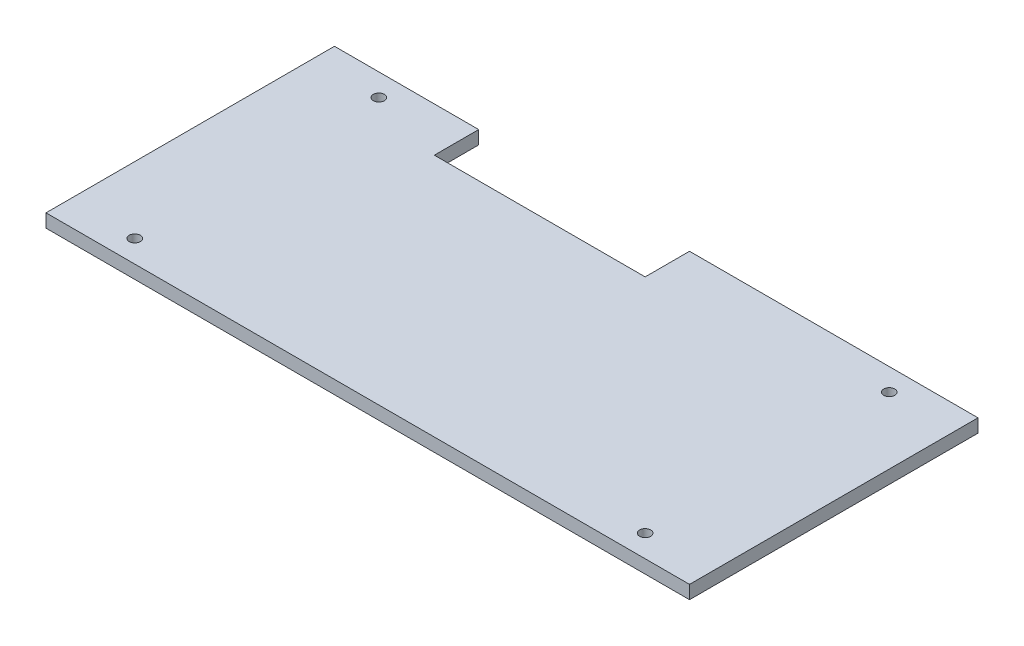
ISO-10303-21;
HEADER;
FILE_DESCRIPTION(('STEP AP214'),'2;1');
FILE_NAME('part.step','',(''),(''),'','','');
FILE_SCHEMA(('AUTOMOTIVE_DESIGN { 1 0 10303 214 1 1 1 1 }'));
ENDSEC;
DATA;
#1=APPLICATION_CONTEXT('core data for automotive mechanical design processes');
#2=APPLICATION_PROTOCOL_DEFINITION('international standard','automotive_design',2000,#1);
#3=PRODUCT_CONTEXT('',#1,'mechanical');
#4=PRODUCT('Part','Part','',(#3));
#5=PRODUCT_RELATED_PRODUCT_CATEGORY('part','',(#4));
#6=PRODUCT_DEFINITION_FORMATION('','',#4);
#7=PRODUCT_DEFINITION_CONTEXT('part definition',#1,'design');
#8=PRODUCT_DEFINITION('design','',#6,#7);
#9=PRODUCT_DEFINITION_SHAPE('','',#8);
#10=(LENGTH_UNIT() NAMED_UNIT(*) SI_UNIT(.MILLI.,.METRE.));
#11=(NAMED_UNIT(*) PLANE_ANGLE_UNIT() SI_UNIT($,.RADIAN.));
#12=(NAMED_UNIT(*) SI_UNIT($,.STERADIAN.) SOLID_ANGLE_UNIT());
#13=UNCERTAINTY_MEASURE_WITH_UNIT(LENGTH_MEASURE(1.E-05),#10,'distance_accuracy_value','');
#14=(GEOMETRIC_REPRESENTATION_CONTEXT(3) GLOBAL_UNCERTAINTY_ASSIGNED_CONTEXT((#13)) GLOBAL_UNIT_ASSIGNED_CONTEXT((#10,
#11,#12)) REPRESENTATION_CONTEXT('',''));
#15=CARTESIAN_POINT('',(0.,0.,0.));
#16=DIRECTION('',(0.,0.,1.));
#17=DIRECTION('',(1.,0.,0.));
#18=AXIS2_PLACEMENT_3D('',#15,#16,#17);
#19=CARTESIAN_POINT('',(0.,6.,0.));
#20=DIRECTION('',(0.,1.,0.));
#21=DIRECTION('',(0.,0.,1.));
#22=AXIS2_PLACEMENT_3D('',#19,#20,#21);
#23=PLANE('',#22);
#24=CARTESIAN_POINT('',(100.,6.,55.));
#25=DIRECTION('',(0.,1.,0.));
#26=DIRECTION('',(0.,0.,1.));
#27=AXIS2_PLACEMENT_3D('',#24,#25,#26);
#28=CIRCLE('',#27,2.5);
#29=CARTESIAN_POINT('',(100.,6.,57.5));
#30=VERTEX_POINT('',#29);
#31=EDGE_CURVE('E188',#30,#30,#28,.T.);
#32=ORIENTED_EDGE('',*,*,#31,.F.);
#33=EDGE_LOOP('',(#32));
#34=FACE_BOUND('',#33,.T.);
#35=CARTESIAN_POINT('',(-130.,6.,-55.));
#36=DIRECTION('',(0.,1.,0.));
#37=DIRECTION('',(0.,0.,1.));
#38=AXIS2_PLACEMENT_3D('',#35,#36,#37);
#39=CIRCLE('',#38,2.5);
#40=CARTESIAN_POINT('',(-130.,6.,-52.5));
#41=VERTEX_POINT('',#40);
#42=EDGE_CURVE('E134',#41,#41,#39,.T.);
#43=ORIENTED_EDGE('',*,*,#42,.F.);
#44=EDGE_LOOP('',(#43));
#45=FACE_BOUND('',#44,.T.);
#46=DIRECTION('',(0.,0.,1.));
#47=VECTOR('',#46,1.);
#48=CARTESIAN_POINT('',(-160.,6.,-65.));
#49=LINE('',#48,#47);
#50=CARTESIAN_POINT('',(-160.,6.,-65.));
#51=VERTEX_POINT('',#50);
#52=CARTESIAN_POINT('',(-160.,6.,65.));
#53=VERTEX_POINT('',#52);
#54=EDGE_CURVE('E145',#51,#53,#49,.T.);
#55=ORIENTED_EDGE('',*,*,#54,.T.);
#56=DIRECTION('',(1.,0.,0.));
#57=VECTOR('',#56,1.);
#58=CARTESIAN_POINT('',(-160.,6.,65.));
#59=LINE('',#58,#57);
#60=CARTESIAN_POINT('',(130.,6.,65.));
#61=VERTEX_POINT('',#60);
#62=EDGE_CURVE('E93',#53,#61,#59,.T.);
#63=ORIENTED_EDGE('',*,*,#62,.T.);
#64=DIRECTION('',(0.,0.,-1.));
#65=VECTOR('',#64,1.);
#66=CARTESIAN_POINT('',(130.,6.,65.));
#67=LINE('',#66,#65);
#68=CARTESIAN_POINT('',(130.,6.,-65.));
#69=VERTEX_POINT('',#68);
#70=EDGE_CURVE('E160',#61,#69,#67,.T.);
#71=ORIENTED_EDGE('',*,*,#70,.T.);
#72=DIRECTION('',(-1.,0.,0.));
#73=VECTOR('',#72,1.);
#74=CARTESIAN_POINT('',(130.,6.,-65.));
#75=LINE('',#74,#73);
#76=CARTESIAN_POINT('',(0.,6.,-65.));
#77=VERTEX_POINT('',#76);
#78=EDGE_CURVE('E173',#69,#77,#75,.T.);
#79=ORIENTED_EDGE('',*,*,#78,.T.);
#80=DIRECTION('',(0.,0.,1.));
#81=VECTOR('',#80,1.);
#82=CARTESIAN_POINT('',(0.,6.,-65.));
#83=LINE('',#82,#81);
#84=CARTESIAN_POINT('',(0.,6.,-45.));
#85=VERTEX_POINT('',#84);
#86=EDGE_CURVE('E112',#77,#85,#83,.T.);
#87=ORIENTED_EDGE('',*,*,#86,.T.);
#88=DIRECTION('',(-1.,0.,0.));
#89=VECTOR('',#88,1.);
#90=CARTESIAN_POINT('',(0.,6.,-45.));
#91=LINE('',#90,#89);
#92=CARTESIAN_POINT('',(-95.,6.,-45.));
#93=VERTEX_POINT('',#92);
#94=EDGE_CURVE('E106',#85,#93,#91,.T.);
#95=ORIENTED_EDGE('',*,*,#94,.T.);
#96=DIRECTION('',(0.,0.,-1.));
#97=VECTOR('',#96,1.);
#98=CARTESIAN_POINT('',(-95.,6.,-45.));
#99=LINE('',#98,#97);
#100=CARTESIAN_POINT('',(-95.,6.,-65.));
#101=VERTEX_POINT('',#100);
#102=EDGE_CURVE('E110',#93,#101,#99,.T.);
#103=ORIENTED_EDGE('',*,*,#102,.T.);
#104=DIRECTION('',(-1.,0.,0.));
#105=VECTOR('',#104,1.);
#106=CARTESIAN_POINT('',(-95.,6.,-65.));
#107=LINE('',#106,#105);
#108=EDGE_CURVE('E50',#101,#51,#107,.T.);
#109=ORIENTED_EDGE('',*,*,#108,.T.);
#110=EDGE_LOOP('',(#55,#63,#71,#79,#87,#95,#103,#109));
#111=FACE_BOUND('',#110,.T.);
#112=CARTESIAN_POINT('',(100.,6.,-55.));
#113=DIRECTION('',(0.,1.,0.));
#114=DIRECTION('',(0.,0.,1.));
#115=AXIS2_PLACEMENT_3D('',#112,#113,#114);
#116=CIRCLE('',#115,2.5);
#117=CARTESIAN_POINT('',(100.,6.,-52.5));
#118=VERTEX_POINT('',#117);
#119=EDGE_CURVE('E182',#118,#118,#116,.T.);
#120=ORIENTED_EDGE('',*,*,#119,.F.);
#121=EDGE_LOOP('',(#120));
#122=FACE_BOUND('',#121,.T.);
#123=CARTESIAN_POINT('',(-130.,6.,55.));
#124=DIRECTION('',(0.,1.,0.));
#125=DIRECTION('',(0.,0.,1.));
#126=AXIS2_PLACEMENT_3D('',#123,#124,#125);
#127=CIRCLE('',#126,2.5);
#128=CARTESIAN_POINT('',(-130.,6.,57.5));
#129=VERTEX_POINT('',#128);
#130=EDGE_CURVE('E194',#129,#129,#127,.T.);
#131=ORIENTED_EDGE('',*,*,#130,.F.);
#132=EDGE_LOOP('',(#131));
#133=FACE_BOUND('',#132,.T.);
#134=ADVANCED_FACE('F33',(#34,#45,#111,#122,#133),#23,.T.);
#135=CARTESIAN_POINT('',(0.,0.,0.));
#136=DIRECTION('',(0.,1.,0.));
#137=DIRECTION('',(0.,0.,1.));
#138=AXIS2_PLACEMENT_3D('',#135,#136,#137);
#139=PLANE('',#138);
#140=DIRECTION('',(0.,0.,1.));
#141=VECTOR('',#140,1.);
#142=CARTESIAN_POINT('',(-160.,0.,-65.));
#143=LINE('',#142,#141);
#144=CARTESIAN_POINT('',(-160.,0.,-65.));
#145=VERTEX_POINT('',#144);
#146=CARTESIAN_POINT('',(-160.,0.,65.));
#147=VERTEX_POINT('',#146);
#148=EDGE_CURVE('E130',#145,#147,#143,.T.);
#149=ORIENTED_EDGE('',*,*,#148,.F.);
#150=DIRECTION('',(-1.,0.,0.));
#151=VECTOR('',#150,1.);
#152=CARTESIAN_POINT('',(-95.,0.,-65.));
#153=LINE('',#152,#151);
#154=CARTESIAN_POINT('',(-95.,0.,-65.));
#155=VERTEX_POINT('',#154);
#156=EDGE_CURVE('E85',#155,#145,#153,.T.);
#157=ORIENTED_EDGE('',*,*,#156,.F.);
#158=DIRECTION('',(0.,0.,-1.));
#159=VECTOR('',#158,1.);
#160=CARTESIAN_POINT('',(-95.,0.,-45.));
#161=LINE('',#160,#159);
#162=CARTESIAN_POINT('',(-95.,0.,-45.));
#163=VERTEX_POINT('',#162);
#164=EDGE_CURVE('E79',#163,#155,#161,.T.);
#165=ORIENTED_EDGE('',*,*,#164,.F.);
#166=DIRECTION('',(-1.,0.,0.));
#167=VECTOR('',#166,1.);
#168=CARTESIAN_POINT('',(0.,0.,-45.));
#169=LINE('',#168,#167);
#170=CARTESIAN_POINT('',(0.,0.,-45.));
#171=VERTEX_POINT('',#170);
#172=EDGE_CURVE('E120',#171,#163,#169,.T.);
#173=ORIENTED_EDGE('',*,*,#172,.F.);
#174=DIRECTION('',(0.,0.,1.));
#175=VECTOR('',#174,1.);
#176=CARTESIAN_POINT('',(0.,0.,-65.));
#177=LINE('',#176,#175);
#178=CARTESIAN_POINT('',(0.,0.,-65.));
#179=VERTEX_POINT('',#178);
#180=EDGE_CURVE('E140',#179,#171,#177,.T.);
#181=ORIENTED_EDGE('',*,*,#180,.F.);
#182=DIRECTION('',(-1.,0.,0.));
#183=VECTOR('',#182,1.);
#184=CARTESIAN_POINT('',(130.,0.,-65.));
#185=LINE('',#184,#183);
#186=CARTESIAN_POINT('',(130.,0.,-65.));
#187=VERTEX_POINT('',#186);
#188=EDGE_CURVE('E138',#187,#179,#185,.T.);
#189=ORIENTED_EDGE('',*,*,#188,.F.);
#190=DIRECTION('',(0.,0.,-1.));
#191=VECTOR('',#190,1.);
#192=CARTESIAN_POINT('',(130.,0.,65.));
#193=LINE('',#192,#191);
#194=CARTESIAN_POINT('',(130.,0.,65.));
#195=VERTEX_POINT('',#194);
#196=EDGE_CURVE('E136',#195,#187,#193,.T.);
#197=ORIENTED_EDGE('',*,*,#196,.F.);
#198=DIRECTION('',(1.,0.,0.));
#199=VECTOR('',#198,1.);
#200=CARTESIAN_POINT('',(-160.,0.,65.));
#201=LINE('',#200,#199);
#202=EDGE_CURVE('E133',#147,#195,#201,.T.);
#203=ORIENTED_EDGE('',*,*,#202,.F.);
#204=EDGE_LOOP('',(#149,#157,#165,#173,#181,#189,#197,#203));
#205=FACE_BOUND('',#204,.T.);
#206=CARTESIAN_POINT('',(-130.,0.,-55.));
#207=DIRECTION('',(0.,1.,0.));
#208=DIRECTION('',(0.,0.,1.));
#209=AXIS2_PLACEMENT_3D('',#206,#207,#208);
#210=CIRCLE('',#209,2.5);
#211=CARTESIAN_POINT('',(-130.,0.,-52.5));
#212=VERTEX_POINT('',#211);
#213=EDGE_CURVE('E179',#212,#212,#210,.T.);
#214=ORIENTED_EDGE('',*,*,#213,.T.);
#215=EDGE_LOOP('',(#214));
#216=FACE_BOUND('',#215,.T.);
#217=CARTESIAN_POINT('',(100.,0.,-55.));
#218=DIRECTION('',(0.,1.,0.));
#219=DIRECTION('',(0.,0.,1.));
#220=AXIS2_PLACEMENT_3D('',#217,#218,#219);
#221=CIRCLE('',#220,2.5);
#222=CARTESIAN_POINT('',(100.,0.,-52.5));
#223=VERTEX_POINT('',#222);
#224=EDGE_CURVE('E185',#223,#223,#221,.T.);
#225=ORIENTED_EDGE('',*,*,#224,.T.);
#226=EDGE_LOOP('',(#225));
#227=FACE_BOUND('',#226,.T.);
#228=CARTESIAN_POINT('',(100.,0.,55.));
#229=DIRECTION('',(0.,1.,0.));
#230=DIRECTION('',(0.,0.,1.));
#231=AXIS2_PLACEMENT_3D('',#228,#229,#230);
#232=CIRCLE('',#231,2.5);
#233=CARTESIAN_POINT('',(100.,0.,57.5));
#234=VERTEX_POINT('',#233);
#235=EDGE_CURVE('E191',#234,#234,#232,.T.);
#236=ORIENTED_EDGE('',*,*,#235,.T.);
#237=EDGE_LOOP('',(#236));
#238=FACE_BOUND('',#237,.T.);
#239=CARTESIAN_POINT('',(-130.,0.,55.));
#240=DIRECTION('',(0.,1.,0.));
#241=DIRECTION('',(0.,0.,1.));
#242=AXIS2_PLACEMENT_3D('',#239,#240,#241);
#243=CIRCLE('',#242,2.5);
#244=CARTESIAN_POINT('',(-130.,0.,57.5));
#245=VERTEX_POINT('',#244);
#246=EDGE_CURVE('E197',#245,#245,#243,.T.);
#247=ORIENTED_EDGE('',*,*,#246,.T.);
#248=EDGE_LOOP('',(#247));
#249=FACE_BOUND('',#248,.T.);
#250=ADVANCED_FACE('F164',(#205,#216,#227,#238,#249),#139,.F.);
#251=CARTESIAN_POINT('',(-160.,6.,-65.));
#252=DIRECTION('',(1.,0.,0.));
#253=DIRECTION('',(0.,0.,-1.));
#254=AXIS2_PLACEMENT_3D('',#251,#252,#253);
#255=PLANE('',#254);
#256=ORIENTED_EDGE('',*,*,#148,.T.);
#257=DIRECTION('',(0.,-1.,0.));
#258=VECTOR('',#257,1.);
#259=CARTESIAN_POINT('',(-160.,6.,65.));
#260=LINE('',#259,#258);
#261=EDGE_CURVE('E11',#53,#147,#260,.T.);
#262=ORIENTED_EDGE('',*,*,#261,.F.);
#263=ORIENTED_EDGE('',*,*,#54,.F.);
#264=DIRECTION('',(0.,-1.,0.));
#265=VECTOR('',#264,1.);
#266=CARTESIAN_POINT('',(-160.,6.,-65.));
#267=LINE('',#266,#265);
#268=EDGE_CURVE('E126',#51,#145,#267,.T.);
#269=ORIENTED_EDGE('',*,*,#268,.T.);
#270=EDGE_LOOP('',(#256,#262,#263,#269));
#271=FACE_BOUND('',#270,.T.);
#272=ADVANCED_FACE('F35',(#271),#255,.F.);
#273=CARTESIAN_POINT('',(-160.,6.,65.));
#274=DIRECTION('',(0.,0.,-1.));
#275=DIRECTION('',(-1.,0.,0.));
#276=AXIS2_PLACEMENT_3D('',#273,#274,#275);
#277=PLANE('',#276);
#278=ORIENTED_EDGE('',*,*,#202,.T.);
#279=DIRECTION('',(0.,-1.,0.));
#280=VECTOR('',#279,1.);
#281=CARTESIAN_POINT('',(130.,6.,65.));
#282=LINE('',#281,#280);
#283=EDGE_CURVE('E42',#61,#195,#282,.T.);
#284=ORIENTED_EDGE('',*,*,#283,.F.);
#285=ORIENTED_EDGE('',*,*,#62,.F.);
#286=ORIENTED_EDGE('',*,*,#261,.T.);
#287=EDGE_LOOP('',(#278,#284,#285,#286));
#288=FACE_BOUND('',#287,.T.);
#289=ADVANCED_FACE('F231',(#288),#277,.F.);
#290=CARTESIAN_POINT('',(130.,6.,65.));
#291=DIRECTION('',(-1.,0.,0.));
#292=DIRECTION('',(0.,0.,1.));
#293=AXIS2_PLACEMENT_3D('',#290,#291,#292);
#294=PLANE('',#293);
#295=ORIENTED_EDGE('',*,*,#196,.T.);
#296=DIRECTION('',(0.,-1.,0.));
#297=VECTOR('',#296,1.);
#298=CARTESIAN_POINT('',(130.,6.,-65.));
#299=LINE('',#298,#297);
#300=EDGE_CURVE('E152',#69,#187,#299,.T.);
#301=ORIENTED_EDGE('',*,*,#300,.F.);
#302=ORIENTED_EDGE('',*,*,#70,.F.);
#303=ORIENTED_EDGE('',*,*,#283,.T.);
#304=EDGE_LOOP('',(#295,#301,#302,#303));
#305=FACE_BOUND('',#304,.T.);
#306=ADVANCED_FACE('F158',(#305),#294,.F.);
#307=CARTESIAN_POINT('',(130.,6.,-65.));
#308=DIRECTION('',(0.,0.,1.));
#309=DIRECTION('',(1.,0.,0.));
#310=AXIS2_PLACEMENT_3D('',#307,#308,#309);
#311=PLANE('',#310);
#312=ORIENTED_EDGE('',*,*,#188,.T.);
#313=DIRECTION('',(0.,-1.,0.));
#314=VECTOR('',#313,1.);
#315=CARTESIAN_POINT('',(0.,6.,-65.));
#316=LINE('',#315,#314);
#317=EDGE_CURVE('E149',#77,#179,#316,.T.);
#318=ORIENTED_EDGE('',*,*,#317,.F.);
#319=ORIENTED_EDGE('',*,*,#78,.F.);
#320=ORIENTED_EDGE('',*,*,#300,.T.);
#321=EDGE_LOOP('',(#312,#318,#319,#320));
#322=FACE_BOUND('',#321,.T.);
#323=ADVANCED_FACE('F169',(#322),#311,.F.);
#324=CARTESIAN_POINT('',(0.,6.,-65.));
#325=DIRECTION('',(1.,0.,0.));
#326=DIRECTION('',(0.,0.,-1.));
#327=AXIS2_PLACEMENT_3D('',#324,#325,#326);
#328=PLANE('',#327);
#329=ORIENTED_EDGE('',*,*,#180,.T.);
#330=DIRECTION('',(0.,-1.,0.));
#331=VECTOR('',#330,1.);
#332=CARTESIAN_POINT('',(0.,6.,-45.));
#333=LINE('',#332,#331);
#334=EDGE_CURVE('E121',#85,#171,#333,.T.);
#335=ORIENTED_EDGE('',*,*,#334,.F.);
#336=ORIENTED_EDGE('',*,*,#86,.F.);
#337=ORIENTED_EDGE('',*,*,#317,.T.);
#338=EDGE_LOOP('',(#329,#335,#336,#337));
#339=FACE_BOUND('',#338,.T.);
#340=ADVANCED_FACE('F172',(#339),#328,.F.);
#341=CARTESIAN_POINT('',(0.,6.,-45.));
#342=DIRECTION('',(0.,0.,1.));
#343=DIRECTION('',(1.,0.,0.));
#344=AXIS2_PLACEMENT_3D('',#341,#342,#343);
#345=PLANE('',#344);
#346=ORIENTED_EDGE('',*,*,#172,.T.);
#347=DIRECTION('',(0.,-1.,0.));
#348=VECTOR('',#347,1.);
#349=CARTESIAN_POINT('',(-95.,6.,-45.));
#350=LINE('',#349,#348);
#351=EDGE_CURVE('E117',#93,#163,#350,.T.);
#352=ORIENTED_EDGE('',*,*,#351,.F.);
#353=ORIENTED_EDGE('',*,*,#94,.F.);
#354=ORIENTED_EDGE('',*,*,#334,.T.);
#355=EDGE_LOOP('',(#346,#352,#353,#354));
#356=FACE_BOUND('',#355,.T.);
#357=ADVANCED_FACE('F118',(#356),#345,.F.);
#358=CARTESIAN_POINT('',(-95.,6.,-45.));
#359=DIRECTION('',(-1.,0.,0.));
#360=DIRECTION('',(0.,0.,1.));
#361=AXIS2_PLACEMENT_3D('',#358,#359,#360);
#362=PLANE('',#361);
#363=ORIENTED_EDGE('',*,*,#164,.T.);
#364=DIRECTION('',(0.,-1.,0.));
#365=VECTOR('',#364,1.);
#366=CARTESIAN_POINT('',(-95.,6.,-65.));
#367=LINE('',#366,#365);
#368=EDGE_CURVE('E122',#101,#155,#367,.T.);
#369=ORIENTED_EDGE('',*,*,#368,.F.);
#370=ORIENTED_EDGE('',*,*,#102,.F.);
#371=ORIENTED_EDGE('',*,*,#351,.T.);
#372=EDGE_LOOP('',(#363,#369,#370,#371));
#373=FACE_BOUND('',#372,.T.);
#374=ADVANCED_FACE('F124',(#373),#362,.F.);
#375=CARTESIAN_POINT('',(-95.,6.,-65.));
#376=DIRECTION('',(0.,0.,1.));
#377=DIRECTION('',(1.,0.,0.));
#378=AXIS2_PLACEMENT_3D('',#375,#376,#377);
#379=PLANE('',#378);
#380=ORIENTED_EDGE('',*,*,#156,.T.);
#381=ORIENTED_EDGE('',*,*,#268,.F.);
#382=ORIENTED_EDGE('',*,*,#108,.F.);
#383=ORIENTED_EDGE('',*,*,#368,.T.);
#384=EDGE_LOOP('',(#380,#381,#382,#383));
#385=FACE_BOUND('',#384,.T.);
#386=ADVANCED_FACE('F219',(#385),#379,.F.);
#387=CARTESIAN_POINT('',(-130.,6.,-55.));
#388=DIRECTION('',(0.,-1.,0.));
#389=DIRECTION('',(0.,0.,-1.));
#390=AXIS2_PLACEMENT_3D('',#387,#388,#389);
#391=CYLINDRICAL_SURFACE('',#390,2.5);
#392=ORIENTED_EDGE('',*,*,#42,.T.);
#393=EDGE_LOOP('',(#392));
#394=FACE_BOUND('',#393,.T.);
#395=ORIENTED_EDGE('',*,*,#213,.F.);
#396=EDGE_LOOP('',(#395));
#397=FACE_BOUND('',#396,.T.);
#398=ADVANCED_FACE('F216',(#394,#397),#391,.F.);
#399=CARTESIAN_POINT('',(100.,6.,-55.));
#400=DIRECTION('',(0.,-1.,0.));
#401=DIRECTION('',(0.,0.,-1.));
#402=AXIS2_PLACEMENT_3D('',#399,#400,#401);
#403=CYLINDRICAL_SURFACE('',#402,2.5);
#404=ORIENTED_EDGE('',*,*,#119,.T.);
#405=EDGE_LOOP('',(#404));
#406=FACE_BOUND('',#405,.T.);
#407=ORIENTED_EDGE('',*,*,#224,.F.);
#408=EDGE_LOOP('',(#407));
#409=FACE_BOUND('',#408,.T.);
#410=ADVANCED_FACE('F295',(#406,#409),#403,.F.);
#411=CARTESIAN_POINT('',(100.,6.,55.));
#412=DIRECTION('',(0.,-1.,0.));
#413=DIRECTION('',(0.,0.,-1.));
#414=AXIS2_PLACEMENT_3D('',#411,#412,#413);
#415=CYLINDRICAL_SURFACE('',#414,2.5);
#416=ORIENTED_EDGE('',*,*,#31,.T.);
#417=EDGE_LOOP('',(#416));
#418=FACE_BOUND('',#417,.T.);
#419=ORIENTED_EDGE('',*,*,#235,.F.);
#420=EDGE_LOOP('',(#419));
#421=FACE_BOUND('',#420,.T.);
#422=ADVANCED_FACE('F303',(#418,#421),#415,.F.);
#423=CARTESIAN_POINT('',(-130.,6.,55.));
#424=DIRECTION('',(0.,-1.,0.));
#425=DIRECTION('',(0.,0.,-1.));
#426=AXIS2_PLACEMENT_3D('',#423,#424,#425);
#427=CYLINDRICAL_SURFACE('',#426,2.5);
#428=ORIENTED_EDGE('',*,*,#130,.T.);
#429=EDGE_LOOP('',(#428));
#430=FACE_BOUND('',#429,.T.);
#431=ORIENTED_EDGE('',*,*,#246,.F.);
#432=EDGE_LOOP('',(#431));
#433=FACE_BOUND('',#432,.T.);
#434=ADVANCED_FACE('F203',(#430,#433),#427,.F.);
#435=CLOSED_SHELL('',(#134,#250,#272,#289,#306,#323,#340,#357,#374,#386,#398,#410,#422,#434));
#436=MANIFOLD_SOLID_BREP('B2',#435);
#437=ADVANCED_BREP_SHAPE_REPRESENTATION('',(#18,#436),#14);
#438=SHAPE_DEFINITION_REPRESENTATION(#9,#437);
ENDSEC;
END-ISO-10303-21;
